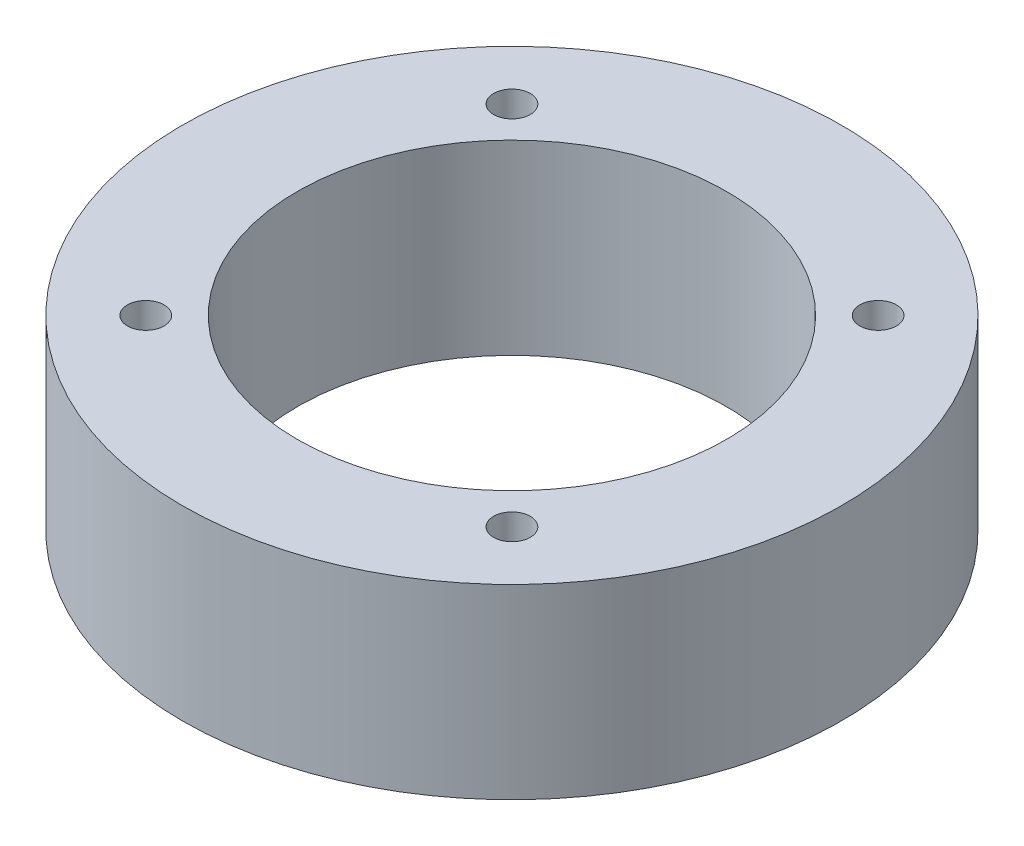
ISO-10303-21;
HEADER;
FILE_DESCRIPTION(('STEP AP214'),'2;1');
FILE_NAME('part.step','',(''),(''),'','','');
FILE_SCHEMA(('AUTOMOTIVE_DESIGN { 1 0 10303 214 1 1 1 1 }'));
ENDSEC;
DATA;
#1=APPLICATION_CONTEXT('core data for automotive mechanical design processes');
#2=APPLICATION_PROTOCOL_DEFINITION('international standard','automotive_design',2000,#1);
#3=PRODUCT_CONTEXT('',#1,'mechanical');
#4=PRODUCT('Part','Part','',(#3));
#5=PRODUCT_RELATED_PRODUCT_CATEGORY('part','',(#4));
#6=PRODUCT_DEFINITION_FORMATION('','',#4);
#7=PRODUCT_DEFINITION_CONTEXT('part definition',#1,'design');
#8=PRODUCT_DEFINITION('design','',#6,#7);
#9=PRODUCT_DEFINITION_SHAPE('','',#8);
#10=(LENGTH_UNIT() NAMED_UNIT(*) SI_UNIT(.MILLI.,.METRE.));
#11=(NAMED_UNIT(*) PLANE_ANGLE_UNIT() SI_UNIT($,.RADIAN.));
#12=(NAMED_UNIT(*) SI_UNIT($,.STERADIAN.) SOLID_ANGLE_UNIT());
#13=UNCERTAINTY_MEASURE_WITH_UNIT(LENGTH_MEASURE(1.E-05),#10,'distance_accuracy_value','');
#14=(GEOMETRIC_REPRESENTATION_CONTEXT(3) GLOBAL_UNCERTAINTY_ASSIGNED_CONTEXT((#13)) GLOBAL_UNIT_ASSIGNED_CONTEXT((#10,
#11,#12)) REPRESENTATION_CONTEXT('',''));
#15=CARTESIAN_POINT('',(0.,0.,0.));
#16=DIRECTION('',(0.,0.,1.));
#17=DIRECTION('',(1.,0.,0.));
#18=AXIS2_PLACEMENT_3D('',#15,#16,#17);
#19=CARTESIAN_POINT('',(0.,14.224,0.));
#20=DIRECTION('',(0.,-1.,0.));
#21=DIRECTION('',(0.,0.,-1.));
#22=AXIS2_PLACEMENT_3D('',#19,#20,#21);
#23=CYLINDRICAL_SURFACE('',#22,25.146);
#24=CARTESIAN_POINT('',(0.,14.224,0.));
#25=DIRECTION('',(0.,1.,0.));
#26=DIRECTION('',(0.,0.,1.));
#27=AXIS2_PLACEMENT_3D('',#24,#25,#26);
#28=CIRCLE('',#27,25.146);
#29=CARTESIAN_POINT('',(0.,14.224,25.146));
#30=VERTEX_POINT('',#29);
#31=EDGE_CURVE('E10',#30,#30,#28,.T.);
#32=ORIENTED_EDGE('',*,*,#31,.F.);
#33=EDGE_LOOP('',(#32));
#34=FACE_BOUND('',#33,.T.);
#35=CARTESIAN_POINT('',(0.,0.,0.));
#36=DIRECTION('',(0.,1.,0.));
#37=DIRECTION('',(0.,0.,1.));
#38=AXIS2_PLACEMENT_3D('',#35,#36,#37);
#39=CIRCLE('',#38,25.146);
#40=CARTESIAN_POINT('',(0.,0.,25.146));
#41=VERTEX_POINT('',#40);
#42=EDGE_CURVE('E33',#41,#41,#39,.T.);
#43=ORIENTED_EDGE('',*,*,#42,.T.);
#44=EDGE_LOOP('',(#43));
#45=FACE_BOUND('',#44,.T.);
#46=ADVANCED_FACE('F30',(#34,#45),#23,.T.);
#47=CARTESIAN_POINT('',(0.,14.224,0.));
#48=DIRECTION('',(0.,1.,0.));
#49=DIRECTION('',(0.,0.,1.));
#50=AXIS2_PLACEMENT_3D('',#47,#48,#49);
#51=PLANE('',#50);
#52=CARTESIAN_POINT('',(0.,14.224,0.));
#53=DIRECTION('',(0.,1.,0.));
#54=DIRECTION('',(0.,0.,1.));
#55=AXIS2_PLACEMENT_3D('',#52,#53,#54);
#56=CIRCLE('',#55,16.383);
#57=CARTESIAN_POINT('',(0.,14.224,16.383));
#58=VERTEX_POINT('',#57);
#59=EDGE_CURVE('E68',#58,#58,#56,.T.);
#60=ORIENTED_EDGE('',*,*,#59,.F.);
#61=EDGE_LOOP('',(#60));
#62=FACE_BOUND('',#61,.T.);
#63=CARTESIAN_POINT('',(-13.97,14.224,-13.97));
#64=DIRECTION('',(0.,1.,0.));
#65=DIRECTION('',(0.,0.,-1.));
#66=AXIS2_PLACEMENT_3D('',#63,#64,#65);
#67=CIRCLE('',#66,1.397);
#68=CARTESIAN_POINT('',(-13.97,14.224,-15.367));
#69=VERTEX_POINT('',#68);
#70=EDGE_CURVE('E62',#69,#69,#67,.T.);
#71=ORIENTED_EDGE('',*,*,#70,.F.);
#72=EDGE_LOOP('',(#71));
#73=FACE_BOUND('',#72,.T.);
#74=CARTESIAN_POINT('',(-13.97,14.224,13.97));
#75=DIRECTION('',(0.,1.,0.));
#76=DIRECTION('',(0.,0.,1.));
#77=AXIS2_PLACEMENT_3D('',#74,#75,#76);
#78=CIRCLE('',#77,1.397);
#79=CARTESIAN_POINT('',(-13.97,14.224,15.367));
#80=VERTEX_POINT('',#79);
#81=EDGE_CURVE('E56',#80,#80,#78,.T.);
#82=ORIENTED_EDGE('',*,*,#81,.F.);
#83=EDGE_LOOP('',(#82));
#84=FACE_BOUND('',#83,.T.);
#85=CARTESIAN_POINT('',(13.97,14.224,13.97));
#86=DIRECTION('',(0.,1.,0.));
#87=DIRECTION('',(0.,0.,-1.));
#88=AXIS2_PLACEMENT_3D('',#85,#86,#87);
#89=CIRCLE('',#88,1.397);
#90=CARTESIAN_POINT('',(13.97,14.224,12.573));
#91=VERTEX_POINT('',#90);
#92=EDGE_CURVE('E50',#91,#91,#89,.T.);
#93=ORIENTED_EDGE('',*,*,#92,.F.);
#94=EDGE_LOOP('',(#93));
#95=FACE_BOUND('',#94,.T.);
#96=CARTESIAN_POINT('',(13.97,14.224,-13.97));
#97=DIRECTION('',(0.,1.,0.));
#98=DIRECTION('',(0.,0.,1.));
#99=AXIS2_PLACEMENT_3D('',#96,#97,#98);
#100=CIRCLE('',#99,1.397);
#101=CARTESIAN_POINT('',(13.97,14.224,-12.573));
#102=VERTEX_POINT('',#101);
#103=EDGE_CURVE('E44',#102,#102,#100,.T.);
#104=ORIENTED_EDGE('',*,*,#103,.F.);
#105=EDGE_LOOP('',(#104));
#106=FACE_BOUND('',#105,.T.);
#107=ORIENTED_EDGE('',*,*,#31,.T.);
#108=EDGE_LOOP('',(#107));
#109=FACE_BOUND('',#108,.T.);
#110=ADVANCED_FACE('F75',(#62,#73,#84,#95,#106,#109),#51,.T.);
#111=CARTESIAN_POINT('',(0.,0.,0.));
#112=DIRECTION('',(0.,1.,0.));
#113=DIRECTION('',(0.,0.,1.));
#114=AXIS2_PLACEMENT_3D('',#111,#112,#113);
#115=PLANE('',#114);
#116=CARTESIAN_POINT('',(0.,0.,0.));
#117=DIRECTION('',(0.,1.,0.));
#118=DIRECTION('',(0.,0.,1.));
#119=AXIS2_PLACEMENT_3D('',#116,#117,#118);
#120=CIRCLE('',#119,16.383);
#121=CARTESIAN_POINT('',(0.,0.,16.383));
#122=VERTEX_POINT('',#121);
#123=EDGE_CURVE('E65',#122,#122,#120,.F.);
#124=ORIENTED_EDGE('',*,*,#123,.F.);
#125=EDGE_LOOP('',(#124));
#126=FACE_BOUND('',#125,.T.);
#127=CARTESIAN_POINT('',(-13.97,0.,-13.97));
#128=DIRECTION('',(0.,1.,0.));
#129=DIRECTION('',(0.,0.,1.));
#130=AXIS2_PLACEMENT_3D('',#127,#128,#129);
#131=CIRCLE('',#130,1.397);
#132=CARTESIAN_POINT('',(-13.97,0.,-12.573));
#133=VERTEX_POINT('',#132);
#134=EDGE_CURVE('E59',#133,#133,#131,.F.);
#135=ORIENTED_EDGE('',*,*,#134,.F.);
#136=EDGE_LOOP('',(#135));
#137=FACE_BOUND('',#136,.T.);
#138=CARTESIAN_POINT('',(-13.97,0.,13.97));
#139=DIRECTION('',(0.,1.,0.));
#140=DIRECTION('',(0.,0.,1.));
#141=AXIS2_PLACEMENT_3D('',#138,#139,#140);
#142=CIRCLE('',#141,1.397);
#143=CARTESIAN_POINT('',(-13.97,0.,15.367));
#144=VERTEX_POINT('',#143);
#145=EDGE_CURVE('E53',#144,#144,#142,.F.);
#146=ORIENTED_EDGE('',*,*,#145,.F.);
#147=EDGE_LOOP('',(#146));
#148=FACE_BOUND('',#147,.T.);
#149=CARTESIAN_POINT('',(13.97,0.,13.97));
#150=DIRECTION('',(0.,1.,0.));
#151=DIRECTION('',(0.,0.,1.));
#152=AXIS2_PLACEMENT_3D('',#149,#150,#151);
#153=CIRCLE('',#152,1.397);
#154=CARTESIAN_POINT('',(13.97,0.,15.367));
#155=VERTEX_POINT('',#154);
#156=EDGE_CURVE('E47',#155,#155,#153,.F.);
#157=ORIENTED_EDGE('',*,*,#156,.F.);
#158=EDGE_LOOP('',(#157));
#159=FACE_BOUND('',#158,.T.);
#160=CARTESIAN_POINT('',(13.97,0.,-13.97));
#161=DIRECTION('',(0.,1.,0.));
#162=DIRECTION('',(0.,0.,1.));
#163=AXIS2_PLACEMENT_3D('',#160,#161,#162);
#164=CIRCLE('',#163,1.397);
#165=CARTESIAN_POINT('',(13.97,0.,-12.573));
#166=VERTEX_POINT('',#165);
#167=EDGE_CURVE('E40',#166,#166,#164,.F.);
#168=ORIENTED_EDGE('',*,*,#167,.F.);
#169=EDGE_LOOP('',(#168));
#170=FACE_BOUND('',#169,.T.);
#171=ORIENTED_EDGE('',*,*,#42,.F.);
#172=EDGE_LOOP('',(#171));
#173=FACE_BOUND('',#172,.T.);
#174=ADVANCED_FACE('F78',(#126,#137,#148,#159,#170,#173),#115,.F.);
#175=CARTESIAN_POINT('',(13.97,-0.000999999999999265,-13.97));
#176=DIRECTION('',(0.,1.,0.));
#177=DIRECTION('',(0.,0.,1.));
#178=AXIS2_PLACEMENT_3D('',#175,#176,#177);
#179=CYLINDRICAL_SURFACE('',#178,1.397);
#180=ORIENTED_EDGE('',*,*,#103,.T.);
#181=EDGE_LOOP('',(#180));
#182=FACE_BOUND('',#181,.T.);
#183=ORIENTED_EDGE('',*,*,#167,.T.);
#184=EDGE_LOOP('',(#183));
#185=FACE_BOUND('',#184,.T.);
#186=ADVANCED_FACE('F88',(#182,#185),#179,.F.);
#187=CARTESIAN_POINT('',(13.97,-0.000999999999999265,13.97));
#188=DIRECTION('',(0.,1.,0.));
#189=DIRECTION('',(0.,0.,1.));
#190=AXIS2_PLACEMENT_3D('',#187,#188,#189);
#191=CYLINDRICAL_SURFACE('',#190,1.397);
#192=ORIENTED_EDGE('',*,*,#92,.T.);
#193=EDGE_LOOP('',(#192));
#194=FACE_BOUND('',#193,.T.);
#195=ORIENTED_EDGE('',*,*,#156,.T.);
#196=EDGE_LOOP('',(#195));
#197=FACE_BOUND('',#196,.T.);
#198=ADVANCED_FACE('F91',(#194,#197),#191,.F.);
#199=CARTESIAN_POINT('',(-13.97,-0.000999999999999265,13.97));
#200=DIRECTION('',(0.,1.,0.));
#201=DIRECTION('',(0.,0.,1.));
#202=AXIS2_PLACEMENT_3D('',#199,#200,#201);
#203=CYLINDRICAL_SURFACE('',#202,1.397);
#204=ORIENTED_EDGE('',*,*,#81,.T.);
#205=EDGE_LOOP('',(#204));
#206=FACE_BOUND('',#205,.T.);
#207=ORIENTED_EDGE('',*,*,#145,.T.);
#208=EDGE_LOOP('',(#207));
#209=FACE_BOUND('',#208,.T.);
#210=ADVANCED_FACE('F124',(#206,#209),#203,.F.);
#211=CARTESIAN_POINT('',(-13.97,-0.000999999999999265,-13.97));
#212=DIRECTION('',(0.,1.,0.));
#213=DIRECTION('',(0.,0.,1.));
#214=AXIS2_PLACEMENT_3D('',#211,#212,#213);
#215=CYLINDRICAL_SURFACE('',#214,1.397);
#216=ORIENTED_EDGE('',*,*,#70,.T.);
#217=EDGE_LOOP('',(#216));
#218=FACE_BOUND('',#217,.T.);
#219=ORIENTED_EDGE('',*,*,#134,.T.);
#220=EDGE_LOOP('',(#219));
#221=FACE_BOUND('',#220,.T.);
#222=ADVANCED_FACE('F132',(#218,#221),#215,.F.);
#223=CARTESIAN_POINT('',(0.,-0.000999999999999265,0.));
#224=DIRECTION('',(0.,1.,0.));
#225=DIRECTION('',(0.,0.,1.));
#226=AXIS2_PLACEMENT_3D('',#223,#224,#225);
#227=CYLINDRICAL_SURFACE('',#226,16.383);
#228=ORIENTED_EDGE('',*,*,#59,.T.);
#229=EDGE_LOOP('',(#228));
#230=FACE_BOUND('',#229,.T.);
#231=ORIENTED_EDGE('',*,*,#123,.T.);
#232=EDGE_LOOP('',(#231));
#233=FACE_BOUND('',#232,.T.);
#234=ADVANCED_FACE('F72',(#230,#233),#227,.F.);
#235=CLOSED_SHELL('',(#46,#110,#174,#186,#198,#210,#222,#234));
#236=MANIFOLD_SOLID_BREP('B2',#235);
#237=ADVANCED_BREP_SHAPE_REPRESENTATION('',(#18,#236),#14);
#238=SHAPE_DEFINITION_REPRESENTATION(#9,#237);
ENDSEC;
END-ISO-10303-21;
